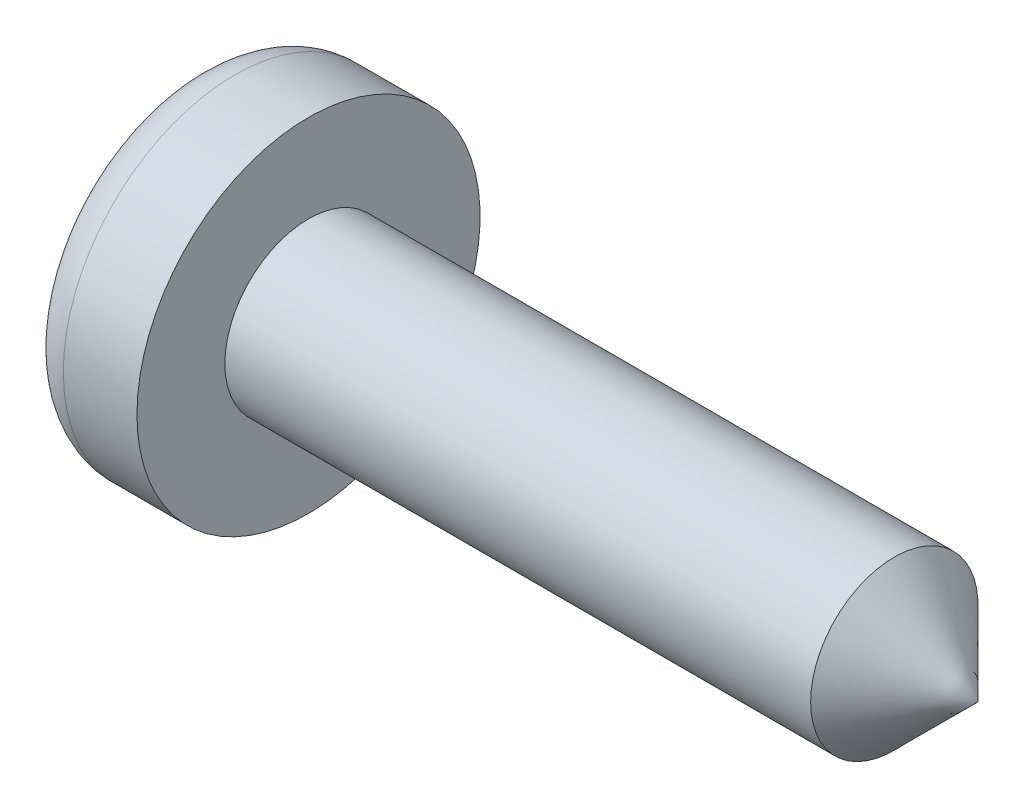
ISO-10303-21;
HEADER;
FILE_DESCRIPTION(('STEP AP214'),'2;1');
FILE_NAME('part.step','',(''),(''),'','','');
FILE_SCHEMA(('AUTOMOTIVE_DESIGN { 1 0 10303 214 1 1 1 1 }'));
ENDSEC;
DATA;
#1=APPLICATION_CONTEXT('core data for automotive mechanical design processes');
#2=APPLICATION_PROTOCOL_DEFINITION('international standard','automotive_design',2000,#1);
#3=PRODUCT_CONTEXT('',#1,'mechanical');
#4=PRODUCT('Part','Part','',(#3));
#5=PRODUCT_RELATED_PRODUCT_CATEGORY('part','',(#4));
#6=PRODUCT_DEFINITION_FORMATION('','',#4);
#7=PRODUCT_DEFINITION_CONTEXT('part definition',#1,'design');
#8=PRODUCT_DEFINITION('design','',#6,#7);
#9=PRODUCT_DEFINITION_SHAPE('','',#8);
#10=(LENGTH_UNIT() NAMED_UNIT(*) SI_UNIT(.MILLI.,.METRE.));
#11=(NAMED_UNIT(*) PLANE_ANGLE_UNIT() SI_UNIT($,.RADIAN.));
#12=(NAMED_UNIT(*) SI_UNIT($,.STERADIAN.) SOLID_ANGLE_UNIT());
#13=UNCERTAINTY_MEASURE_WITH_UNIT(LENGTH_MEASURE(1.E-05),#10,'distance_accuracy_value','');
#14=(GEOMETRIC_REPRESENTATION_CONTEXT(3) GLOBAL_UNCERTAINTY_ASSIGNED_CONTEXT((#13)) GLOBAL_UNIT_ASSIGNED_CONTEXT((#10,
#11,#12)) REPRESENTATION_CONTEXT('',''));
#15=CARTESIAN_POINT('',(0.,0.,0.));
#16=DIRECTION('',(0.,0.,1.));
#17=DIRECTION('',(1.,0.,0.));
#18=AXIS2_PLACEMENT_3D('',#15,#16,#17);
#19=CARTESIAN_POINT('',(0.,0.,0.));
#20=DIRECTION('',(1.,0.,0.));
#21=DIRECTION('',(0.,0.,-1.));
#22=AXIS2_PLACEMENT_3D('',#19,#20,#21);
#23=PLANE('',#22);
#24=CARTESIAN_POINT('',(0.,0.,0.));
#25=DIRECTION('',(1.,0.,0.));
#26=DIRECTION('',(0.,0.,-1.));
#27=AXIS2_PLACEMENT_3D('',#24,#25,#26);
#28=CIRCLE('',#27,1.55);
#29=CARTESIAN_POINT('',(0.,0.,-1.55));
#30=VERTEX_POINT('',#29);
#31=EDGE_CURVE('E47',#30,#30,#28,.F.);
#32=ORIENTED_EDGE('',*,*,#31,.T.);
#33=EDGE_LOOP('',(#32));
#34=FACE_BOUND('',#33,.T.);
#35=DIRECTION('',(0.,0.,-1.));
#36=VECTOR('',#35,1.);
#37=CARTESIAN_POINT('',(0.,0.3,-0.3));
#38=LINE('',#37,#36);
#39=CARTESIAN_POINT('',(0.,0.3,-0.3));
#40=VERTEX_POINT('',#39);
#41=CARTESIAN_POINT('',(0.,0.3,-1.));
#42=VERTEX_POINT('',#41);
#43=EDGE_CURVE('E181',#40,#42,#38,.T.);
#44=ORIENTED_EDGE('',*,*,#43,.F.);
#45=DIRECTION('',(0.,-1.,0.));
#46=VECTOR('',#45,1.);
#47=CARTESIAN_POINT('',(0.,1.,-0.3));
#48=LINE('',#47,#46);
#49=CARTESIAN_POINT('',(0.,1.,-0.3));
#50=VERTEX_POINT('',#49);
#51=EDGE_CURVE('E54',#50,#40,#48,.T.);
#52=ORIENTED_EDGE('',*,*,#51,.F.);
#53=DIRECTION('',(0.,0.,-1.));
#54=VECTOR('',#53,1.);
#55=CARTESIAN_POINT('',(0.,1.,0.3));
#56=LINE('',#55,#54);
#57=CARTESIAN_POINT('',(0.,1.,0.3));
#58=VERTEX_POINT('',#57);
#59=EDGE_CURVE('E149',#58,#50,#56,.T.);
#60=ORIENTED_EDGE('',*,*,#59,.F.);
#61=DIRECTION('',(0.,1.,0.));
#62=VECTOR('',#61,1.);
#63=CARTESIAN_POINT('',(0.,0.3,0.3));
#64=LINE('',#63,#62);
#65=CARTESIAN_POINT('',(0.,0.3,0.3));
#66=VERTEX_POINT('',#65);
#67=EDGE_CURVE('E152',#66,#58,#64,.T.);
#68=ORIENTED_EDGE('',*,*,#67,.F.);
#69=DIRECTION('',(0.,0.,-1.));
#70=VECTOR('',#69,1.);
#71=CARTESIAN_POINT('',(0.,0.3,1.));
#72=LINE('',#71,#70);
#73=CARTESIAN_POINT('',(0.,0.3,1.));
#74=VERTEX_POINT('',#73);
#75=EDGE_CURVE('E204',#74,#66,#72,.T.);
#76=ORIENTED_EDGE('',*,*,#75,.F.);
#77=DIRECTION('',(0.,1.,0.));
#78=VECTOR('',#77,1.);
#79=CARTESIAN_POINT('',(0.,-0.3,1.));
#80=LINE('',#79,#78);
#81=CARTESIAN_POINT('',(0.,-0.3,1.));
#82=VERTEX_POINT('',#81);
#83=EDGE_CURVE('E201',#82,#74,#80,.T.);
#84=ORIENTED_EDGE('',*,*,#83,.F.);
#85=DIRECTION('',(0.,0.,1.));
#86=VECTOR('',#85,1.);
#87=CARTESIAN_POINT('',(0.,-0.3,0.3));
#88=LINE('',#87,#86);
#89=CARTESIAN_POINT('',(0.,-0.3,0.3));
#90=VERTEX_POINT('',#89);
#91=EDGE_CURVE('E198',#90,#82,#88,.T.);
#92=ORIENTED_EDGE('',*,*,#91,.F.);
#93=DIRECTION('',(0.,1.,0.));
#94=VECTOR('',#93,1.);
#95=CARTESIAN_POINT('',(0.,-1.,0.3));
#96=LINE('',#95,#94);
#97=CARTESIAN_POINT('',(0.,-1.,0.3));
#98=VERTEX_POINT('',#97);
#99=EDGE_CURVE('E195',#98,#90,#96,.T.);
#100=ORIENTED_EDGE('',*,*,#99,.F.);
#101=DIRECTION('',(0.,0.,1.));
#102=VECTOR('',#101,1.);
#103=CARTESIAN_POINT('',(0.,-1.,-0.3));
#104=LINE('',#103,#102);
#105=CARTESIAN_POINT('',(0.,-1.,-0.3));
#106=VERTEX_POINT('',#105);
#107=EDGE_CURVE('E192',#106,#98,#104,.T.);
#108=ORIENTED_EDGE('',*,*,#107,.F.);
#109=DIRECTION('',(0.,-1.,0.));
#110=VECTOR('',#109,1.);
#111=CARTESIAN_POINT('',(0.,-0.3,-0.3));
#112=LINE('',#111,#110);
#113=CARTESIAN_POINT('',(0.,-0.3,-0.3));
#114=VERTEX_POINT('',#113);
#115=EDGE_CURVE('E189',#114,#106,#112,.T.);
#116=ORIENTED_EDGE('',*,*,#115,.F.);
#117=DIRECTION('',(0.,0.,1.));
#118=VECTOR('',#117,1.);
#119=CARTESIAN_POINT('',(0.,-0.3,-1.));
#120=LINE('',#119,#118);
#121=CARTESIAN_POINT('',(0.,-0.3,-1.));
#122=VERTEX_POINT('',#121);
#123=EDGE_CURVE('E186',#122,#114,#120,.T.);
#124=ORIENTED_EDGE('',*,*,#123,.F.);
#125=DIRECTION('',(0.,-1.,0.));
#126=VECTOR('',#125,1.);
#127=CARTESIAN_POINT('',(0.,0.3,-1.));
#128=LINE('',#127,#126);
#129=EDGE_CURVE('E183',#42,#122,#128,.T.);
#130=ORIENTED_EDGE('',*,*,#129,.F.);
#131=EDGE_LOOP('',(#44,#52,#60,#68,#76,#84,#92,#100,#108,#116,#124,#130));
#132=FACE_BOUND('',#131,.T.);
#133=ADVANCED_FACE('F39',(#34,#132),#23,.F.);
#134=CARTESIAN_POINT('',(-6.97654015251013,0.,0.));
#135=DIRECTION('',(-1.,0.,0.));
#136=DIRECTION('',(0.,0.,1.));
#137=AXIS2_PLACEMENT_3D('',#134,#135,#136);
#138=CYLINDRICAL_SURFACE('',#137,2.05);
#139=CARTESIAN_POINT('',(0.5,0.,0.));
#140=DIRECTION('',(1.,0.,0.));
#141=DIRECTION('',(0.,0.,-1.));
#142=AXIS2_PLACEMENT_3D('',#139,#140,#141);
#143=CIRCLE('',#142,2.05);
#144=CARTESIAN_POINT('',(0.5,0.,-2.05));
#145=VERTEX_POINT('',#144);
#146=EDGE_CURVE('E11',#145,#145,#143,.T.);
#147=ORIENTED_EDGE('',*,*,#146,.T.);
#148=EDGE_LOOP('',(#147));
#149=FACE_BOUND('',#148,.T.);
#150=CARTESIAN_POINT('',(1.38,0.,0.));
#151=DIRECTION('',(-1.,0.,0.));
#152=DIRECTION('',(0.,0.,1.));
#153=AXIS2_PLACEMENT_3D('',#150,#151,#152);
#154=CIRCLE('',#153,2.05);
#155=CARTESIAN_POINT('',(1.38,0.,2.05));
#156=VERTEX_POINT('',#155);
#157=EDGE_CURVE('E236',#156,#156,#154,.T.);
#158=ORIENTED_EDGE('',*,*,#157,.T.);
#159=EDGE_LOOP('',(#158));
#160=FACE_BOUND('',#159,.T.);
#161=ADVANCED_FACE('F251',(#149,#160),#138,.T.);
#162=CARTESIAN_POINT('',(1.38,2.05,0.));
#163=DIRECTION('',(-1.,0.,0.));
#164=DIRECTION('',(0.,0.,1.));
#165=AXIS2_PLACEMENT_3D('',#162,#163,#164);
#166=PLANE('',#165);
#167=ORIENTED_EDGE('',*,*,#157,.F.);
#168=EDGE_LOOP('',(#167));
#169=FACE_BOUND('',#168,.T.);
#170=CARTESIAN_POINT('',(1.38,0.,0.));
#171=DIRECTION('',(-1.,0.,0.));
#172=DIRECTION('',(0.,0.,1.));
#173=AXIS2_PLACEMENT_3D('',#170,#171,#172);
#174=CIRCLE('',#173,1.);
#175=CARTESIAN_POINT('',(1.38,0.,1.));
#176=VERTEX_POINT('',#175);
#177=EDGE_CURVE('E233',#176,#176,#174,.T.);
#178=ORIENTED_EDGE('',*,*,#177,.T.);
#179=EDGE_LOOP('',(#178));
#180=FACE_BOUND('',#179,.T.);
#181=ADVANCED_FACE('F255',(#169,#180),#166,.F.);
#182=CARTESIAN_POINT('',(-6.97654015251013,0.,0.));
#183=DIRECTION('',(-1.,0.,0.));
#184=DIRECTION('',(0.,0.,1.));
#185=AXIS2_PLACEMENT_3D('',#182,#183,#184);
#186=CYLINDRICAL_SURFACE('',#185,1.);
#187=ORIENTED_EDGE('',*,*,#177,.F.);
#188=EDGE_LOOP('',(#187));
#189=FACE_BOUND('',#188,.T.);
#190=CARTESIAN_POINT('',(8.37999999999999,0.,0.));
#191=DIRECTION('',(-1.,0.,0.));
#192=DIRECTION('',(0.,0.,1.));
#193=AXIS2_PLACEMENT_3D('',#190,#191,#192);
#194=CIRCLE('',#193,1.);
#195=CARTESIAN_POINT('',(8.37999999999999,0.,1.));
#196=VERTEX_POINT('',#195);
#197=EDGE_CURVE('E211',#196,#196,#194,.T.);
#198=ORIENTED_EDGE('',*,*,#197,.T.);
#199=EDGE_LOOP('',(#198));
#200=FACE_BOUND('',#199,.T.);
#201=ADVANCED_FACE('F261',(#189,#200),#186,.T.);
#202=CARTESIAN_POINT('',(9.38,0.,0.));
#203=DIRECTION('',(-1.,0.,0.));
#204=DIRECTION('',(0.,0.,1.));
#205=AXIS2_PLACEMENT_3D('',#202,#203,#204);
#206=CONICAL_SURFACE('',#205,0.,0.785398163397443);
#207=ORIENTED_EDGE('',*,*,#197,.F.);
#208=EDGE_LOOP('',(#207));
#209=FACE_BOUND('',#208,.T.);
#210=CARTESIAN_POINT('',(9.38,0.,0.));
#211=VERTEX_POINT('',#210);
#212=VERTEX_LOOP('',#211);
#213=FACE_BOUND('',#212,.T.);
#214=ADVANCED_FACE('F265',(#209,#213),#206,.T.);
#215=CARTESIAN_POINT('',(0.5,1.,-0.3));
#216=DIRECTION('',(0.,0.,-1.));
#217=DIRECTION('',(0.,1.,0.));
#218=AXIS2_PLACEMENT_3D('',#215,#216,#217);
#219=PLANE('',#218);
#220=ORIENTED_EDGE('',*,*,#51,.T.);
#221=DIRECTION('',(-1.,0.,0.));
#222=VECTOR('',#221,1.);
#223=CARTESIAN_POINT('',(0.5,0.3,-0.3));
#224=LINE('',#223,#222);
#225=CARTESIAN_POINT('',(0.5,0.3,-0.3));
#226=VERTEX_POINT('',#225);
#227=EDGE_CURVE('E126',#226,#40,#224,.T.);
#228=ORIENTED_EDGE('',*,*,#227,.F.);
#229=DIRECTION('',(0.,-1.,0.));
#230=VECTOR('',#229,1.);
#231=CARTESIAN_POINT('',(0.5,1.,-0.3));
#232=LINE('',#231,#230);
#233=CARTESIAN_POINT('',(0.5,1.,-0.3));
#234=VERTEX_POINT('',#233);
#235=EDGE_CURVE('E130',#234,#226,#232,.T.);
#236=ORIENTED_EDGE('',*,*,#235,.F.);
#237=DIRECTION('',(-1.,0.,0.));
#238=VECTOR('',#237,1.);
#239=CARTESIAN_POINT('',(0.5,1.,-0.3));
#240=LINE('',#239,#238);
#241=EDGE_CURVE('E209',#234,#50,#240,.T.);
#242=ORIENTED_EDGE('',*,*,#241,.T.);
#243=EDGE_LOOP('',(#220,#228,#236,#242));
#244=FACE_BOUND('',#243,.T.);
#245=ADVANCED_FACE('F128',(#244),#219,.F.);
#246=CARTESIAN_POINT('',(0.5,1.,0.3));
#247=DIRECTION('',(0.,1.,0.));
#248=DIRECTION('',(0.,0.,1.));
#249=AXIS2_PLACEMENT_3D('',#246,#247,#248);
#250=PLANE('',#249);
#251=ORIENTED_EDGE('',*,*,#59,.T.);
#252=ORIENTED_EDGE('',*,*,#241,.F.);
#253=DIRECTION('',(0.,0.,-1.));
#254=VECTOR('',#253,1.);
#255=CARTESIAN_POINT('',(0.5,1.,0.3));
#256=LINE('',#255,#254);
#257=CARTESIAN_POINT('',(0.5,1.,0.3));
#258=VERTEX_POINT('',#257);
#259=EDGE_CURVE('E136',#258,#234,#256,.T.);
#260=ORIENTED_EDGE('',*,*,#259,.F.);
#261=DIRECTION('',(-1.,0.,0.));
#262=VECTOR('',#261,1.);
#263=CARTESIAN_POINT('',(0.5,1.,0.3));
#264=LINE('',#263,#262);
#265=EDGE_CURVE('E212',#258,#58,#264,.T.);
#266=ORIENTED_EDGE('',*,*,#265,.T.);
#267=EDGE_LOOP('',(#251,#252,#260,#266));
#268=FACE_BOUND('',#267,.T.);
#269=ADVANCED_FACE('F272',(#268),#250,.F.);
#270=CARTESIAN_POINT('',(0.5,0.3,0.3));
#271=DIRECTION('',(0.,0.,1.));
#272=DIRECTION('',(0.,-1.,0.));
#273=AXIS2_PLACEMENT_3D('',#270,#271,#272);
#274=PLANE('',#273);
#275=ORIENTED_EDGE('',*,*,#67,.T.);
#276=ORIENTED_EDGE('',*,*,#265,.F.);
#277=DIRECTION('',(0.,1.,0.));
#278=VECTOR('',#277,1.);
#279=CARTESIAN_POINT('',(0.5,0.3,0.3));
#280=LINE('',#279,#278);
#281=CARTESIAN_POINT('',(0.5,0.3,0.3));
#282=VERTEX_POINT('',#281);
#283=EDGE_CURVE('E177',#282,#258,#280,.T.);
#284=ORIENTED_EDGE('',*,*,#283,.F.);
#285=DIRECTION('',(-1.,0.,0.));
#286=VECTOR('',#285,1.);
#287=CARTESIAN_POINT('',(0.5,0.3,0.3));
#288=LINE('',#287,#286);
#289=EDGE_CURVE('E214',#282,#66,#288,.T.);
#290=ORIENTED_EDGE('',*,*,#289,.T.);
#291=EDGE_LOOP('',(#275,#276,#284,#290));
#292=FACE_BOUND('',#291,.T.);
#293=ADVANCED_FACE('F306',(#292),#274,.F.);
#294=CARTESIAN_POINT('',(0.5,0.3,1.));
#295=DIRECTION('',(0.,1.,0.));
#296=DIRECTION('',(0.,0.,1.));
#297=AXIS2_PLACEMENT_3D('',#294,#295,#296);
#298=PLANE('',#297);
#299=ORIENTED_EDGE('',*,*,#75,.T.);
#300=ORIENTED_EDGE('',*,*,#289,.F.);
#301=DIRECTION('',(0.,0.,-1.));
#302=VECTOR('',#301,1.);
#303=CARTESIAN_POINT('',(0.5,0.3,1.));
#304=LINE('',#303,#302);
#305=CARTESIAN_POINT('',(0.5,0.3,1.));
#306=VERTEX_POINT('',#305);
#307=EDGE_CURVE('E174',#306,#282,#304,.T.);
#308=ORIENTED_EDGE('',*,*,#307,.F.);
#309=DIRECTION('',(-1.,0.,0.));
#310=VECTOR('',#309,1.);
#311=CARTESIAN_POINT('',(0.5,0.3,1.));
#312=LINE('',#311,#310);
#313=EDGE_CURVE('E216',#306,#74,#312,.T.);
#314=ORIENTED_EDGE('',*,*,#313,.T.);
#315=EDGE_LOOP('',(#299,#300,#308,#314));
#316=FACE_BOUND('',#315,.T.);
#317=ADVANCED_FACE('F302',(#316),#298,.F.);
#318=CARTESIAN_POINT('',(0.5,-0.3,1.));
#319=DIRECTION('',(0.,0.,1.));
#320=DIRECTION('',(1.,0.,0.));
#321=AXIS2_PLACEMENT_3D('',#318,#319,#320);
#322=PLANE('',#321);
#323=ORIENTED_EDGE('',*,*,#83,.T.);
#324=ORIENTED_EDGE('',*,*,#313,.F.);
#325=DIRECTION('',(0.,1.,0.));
#326=VECTOR('',#325,1.);
#327=CARTESIAN_POINT('',(0.5,-0.3,1.));
#328=LINE('',#327,#326);
#329=CARTESIAN_POINT('',(0.5,-0.3,1.));
#330=VERTEX_POINT('',#329);
#331=EDGE_CURVE('E171',#330,#306,#328,.T.);
#332=ORIENTED_EDGE('',*,*,#331,.F.);
#333=DIRECTION('',(-1.,0.,0.));
#334=VECTOR('',#333,1.);
#335=CARTESIAN_POINT('',(0.5,-0.3,1.));
#336=LINE('',#335,#334);
#337=EDGE_CURVE('E218',#330,#82,#336,.T.);
#338=ORIENTED_EDGE('',*,*,#337,.T.);
#339=EDGE_LOOP('',(#323,#324,#332,#338));
#340=FACE_BOUND('',#339,.T.);
#341=ADVANCED_FACE('F298',(#340),#322,.F.);
#342=CARTESIAN_POINT('',(0.5,-0.3,0.3));
#343=DIRECTION('',(0.,-1.,0.));
#344=DIRECTION('',(0.,0.,-1.));
#345=AXIS2_PLACEMENT_3D('',#342,#343,#344);
#346=PLANE('',#345);
#347=ORIENTED_EDGE('',*,*,#91,.T.);
#348=ORIENTED_EDGE('',*,*,#337,.F.);
#349=DIRECTION('',(0.,0.,1.));
#350=VECTOR('',#349,1.);
#351=CARTESIAN_POINT('',(0.5,-0.3,0.3));
#352=LINE('',#351,#350);
#353=CARTESIAN_POINT('',(0.5,-0.3,0.3));
#354=VERTEX_POINT('',#353);
#355=EDGE_CURVE('E168',#354,#330,#352,.T.);
#356=ORIENTED_EDGE('',*,*,#355,.F.);
#357=DIRECTION('',(-1.,0.,0.));
#358=VECTOR('',#357,1.);
#359=CARTESIAN_POINT('',(0.5,-0.3,0.3));
#360=LINE('',#359,#358);
#361=EDGE_CURVE('E220',#354,#90,#360,.T.);
#362=ORIENTED_EDGE('',*,*,#361,.T.);
#363=EDGE_LOOP('',(#347,#348,#356,#362));
#364=FACE_BOUND('',#363,.T.);
#365=ADVANCED_FACE('F294',(#364),#346,.F.);
#366=CARTESIAN_POINT('',(0.5,-1.,0.3));
#367=DIRECTION('',(0.,0.,1.));
#368=DIRECTION('',(1.,0.,0.));
#369=AXIS2_PLACEMENT_3D('',#366,#367,#368);
#370=PLANE('',#369);
#371=ORIENTED_EDGE('',*,*,#99,.T.);
#372=ORIENTED_EDGE('',*,*,#361,.F.);
#373=DIRECTION('',(0.,1.,0.));
#374=VECTOR('',#373,1.);
#375=CARTESIAN_POINT('',(0.5,-1.,0.3));
#376=LINE('',#375,#374);
#377=CARTESIAN_POINT('',(0.5,-1.,0.3));
#378=VERTEX_POINT('',#377);
#379=EDGE_CURVE('E165',#378,#354,#376,.T.);
#380=ORIENTED_EDGE('',*,*,#379,.F.);
#381=DIRECTION('',(-1.,0.,0.));
#382=VECTOR('',#381,1.);
#383=CARTESIAN_POINT('',(0.5,-1.,0.3));
#384=LINE('',#383,#382);
#385=EDGE_CURVE('E222',#378,#98,#384,.T.);
#386=ORIENTED_EDGE('',*,*,#385,.T.);
#387=EDGE_LOOP('',(#371,#372,#380,#386));
#388=FACE_BOUND('',#387,.T.);
#389=ADVANCED_FACE('F290',(#388),#370,.F.);
#390=CARTESIAN_POINT('',(0.5,-1.,-0.3));
#391=DIRECTION('',(0.,-1.,0.));
#392=DIRECTION('',(0.,0.,-1.));
#393=AXIS2_PLACEMENT_3D('',#390,#391,#392);
#394=PLANE('',#393);
#395=ORIENTED_EDGE('',*,*,#107,.T.);
#396=ORIENTED_EDGE('',*,*,#385,.F.);
#397=DIRECTION('',(0.,0.,1.));
#398=VECTOR('',#397,1.);
#399=CARTESIAN_POINT('',(0.5,-1.,-0.3));
#400=LINE('',#399,#398);
#401=CARTESIAN_POINT('',(0.5,-1.,-0.3));
#402=VERTEX_POINT('',#401);
#403=EDGE_CURVE('E162',#402,#378,#400,.T.);
#404=ORIENTED_EDGE('',*,*,#403,.F.);
#405=DIRECTION('',(-1.,0.,0.));
#406=VECTOR('',#405,1.);
#407=CARTESIAN_POINT('',(0.5,-1.,-0.3));
#408=LINE('',#407,#406);
#409=EDGE_CURVE('E224',#402,#106,#408,.T.);
#410=ORIENTED_EDGE('',*,*,#409,.T.);
#411=EDGE_LOOP('',(#395,#396,#404,#410));
#412=FACE_BOUND('',#411,.T.);
#413=ADVANCED_FACE('F286',(#412),#394,.F.);
#414=CARTESIAN_POINT('',(0.5,-0.3,-0.3));
#415=DIRECTION('',(0.,0.,-1.));
#416=DIRECTION('',(0.,1.,0.));
#417=AXIS2_PLACEMENT_3D('',#414,#415,#416);
#418=PLANE('',#417);
#419=ORIENTED_EDGE('',*,*,#115,.T.);
#420=ORIENTED_EDGE('',*,*,#409,.F.);
#421=DIRECTION('',(0.,-1.,0.));
#422=VECTOR('',#421,1.);
#423=CARTESIAN_POINT('',(0.5,-0.3,-0.3));
#424=LINE('',#423,#422);
#425=CARTESIAN_POINT('',(0.5,-0.3,-0.3));
#426=VERTEX_POINT('',#425);
#427=EDGE_CURVE('E159',#426,#402,#424,.T.);
#428=ORIENTED_EDGE('',*,*,#427,.F.);
#429=DIRECTION('',(-1.,0.,0.));
#430=VECTOR('',#429,1.);
#431=CARTESIAN_POINT('',(0.5,-0.3,-0.3));
#432=LINE('',#431,#430);
#433=EDGE_CURVE('E226',#426,#114,#432,.T.);
#434=ORIENTED_EDGE('',*,*,#433,.T.);
#435=EDGE_LOOP('',(#419,#420,#428,#434));
#436=FACE_BOUND('',#435,.T.);
#437=ADVANCED_FACE('F282',(#436),#418,.F.);
#438=CARTESIAN_POINT('',(0.5,-0.3,-1.));
#439=DIRECTION('',(0.,-1.,0.));
#440=DIRECTION('',(0.,0.,-1.));
#441=AXIS2_PLACEMENT_3D('',#438,#439,#440);
#442=PLANE('',#441);
#443=ORIENTED_EDGE('',*,*,#123,.T.);
#444=ORIENTED_EDGE('',*,*,#433,.F.);
#445=DIRECTION('',(0.,0.,1.));
#446=VECTOR('',#445,1.);
#447=CARTESIAN_POINT('',(0.5,-0.3,-1.));
#448=LINE('',#447,#446);
#449=CARTESIAN_POINT('',(0.5,-0.3,-1.));
#450=VERTEX_POINT('',#449);
#451=EDGE_CURVE('E156',#450,#426,#448,.T.);
#452=ORIENTED_EDGE('',*,*,#451,.F.);
#453=DIRECTION('',(-1.,0.,0.));
#454=VECTOR('',#453,1.);
#455=CARTESIAN_POINT('',(0.5,-0.3,-1.));
#456=LINE('',#455,#454);
#457=EDGE_CURVE('E228',#450,#122,#456,.T.);
#458=ORIENTED_EDGE('',*,*,#457,.T.);
#459=EDGE_LOOP('',(#443,#444,#452,#458));
#460=FACE_BOUND('',#459,.T.);
#461=ADVANCED_FACE('F278',(#460),#442,.F.);
#462=CARTESIAN_POINT('',(0.5,0.3,-1.));
#463=DIRECTION('',(0.,0.,-1.));
#464=DIRECTION('',(-1.,0.,0.));
#465=AXIS2_PLACEMENT_3D('',#462,#463,#464);
#466=PLANE('',#465);
#467=ORIENTED_EDGE('',*,*,#129,.T.);
#468=ORIENTED_EDGE('',*,*,#457,.F.);
#469=DIRECTION('',(0.,-1.,0.));
#470=VECTOR('',#469,1.);
#471=CARTESIAN_POINT('',(0.5,0.3,-1.));
#472=LINE('',#471,#470);
#473=CARTESIAN_POINT('',(0.5,0.3,-1.));
#474=VERTEX_POINT('',#473);
#475=EDGE_CURVE('E144',#474,#450,#472,.T.);
#476=ORIENTED_EDGE('',*,*,#475,.F.);
#477=DIRECTION('',(-1.,0.,0.));
#478=VECTOR('',#477,1.);
#479=CARTESIAN_POINT('',(0.5,0.3,-1.));
#480=LINE('',#479,#478);
#481=EDGE_CURVE('E135',#474,#42,#480,.T.);
#482=ORIENTED_EDGE('',*,*,#481,.T.);
#483=EDGE_LOOP('',(#467,#468,#476,#482));
#484=FACE_BOUND('',#483,.T.);
#485=ADVANCED_FACE('F275',(#484),#466,.F.);
#486=CARTESIAN_POINT('',(0.5,0.3,-0.3));
#487=DIRECTION('',(0.,1.,0.));
#488=DIRECTION('',(0.,0.,1.));
#489=AXIS2_PLACEMENT_3D('',#486,#487,#488);
#490=PLANE('',#489);
#491=ORIENTED_EDGE('',*,*,#43,.T.);
#492=ORIENTED_EDGE('',*,*,#481,.F.);
#493=DIRECTION('',(0.,0.,-1.));
#494=VECTOR('',#493,1.);
#495=CARTESIAN_POINT('',(0.5,0.3,-0.3));
#496=LINE('',#495,#494);
#497=EDGE_CURVE('E139',#226,#474,#496,.T.);
#498=ORIENTED_EDGE('',*,*,#497,.F.);
#499=ORIENTED_EDGE('',*,*,#227,.T.);
#500=EDGE_LOOP('',(#491,#492,#498,#499));
#501=FACE_BOUND('',#500,.T.);
#502=ADVANCED_FACE('F140',(#501),#490,.F.);
#503=CARTESIAN_POINT('',(0.5,0.,0.));
#504=DIRECTION('',(1.,0.,0.));
#505=DIRECTION('',(0.,0.,-1.));
#506=AXIS2_PLACEMENT_3D('',#503,#504,#505);
#507=PLANE('',#506);
#508=ORIENTED_EDGE('',*,*,#235,.T.);
#509=ORIENTED_EDGE('',*,*,#497,.T.);
#510=ORIENTED_EDGE('',*,*,#475,.T.);
#511=ORIENTED_EDGE('',*,*,#451,.T.);
#512=ORIENTED_EDGE('',*,*,#427,.T.);
#513=ORIENTED_EDGE('',*,*,#403,.T.);
#514=ORIENTED_EDGE('',*,*,#379,.T.);
#515=ORIENTED_EDGE('',*,*,#355,.T.);
#516=ORIENTED_EDGE('',*,*,#331,.T.);
#517=ORIENTED_EDGE('',*,*,#307,.T.);
#518=ORIENTED_EDGE('',*,*,#283,.T.);
#519=ORIENTED_EDGE('',*,*,#259,.T.);
#520=EDGE_LOOP('',(#508,#509,#510,#511,#512,#513,#514,#515,#516,#517,#518,#519));
#521=FACE_BOUND('',#520,.T.);
#522=ADVANCED_FACE('F146',(#521),#507,.F.);
#523=CARTESIAN_POINT('',(0.5,0.,0.));
#524=DIRECTION('',(1.,0.,0.));
#525=DIRECTION('',(0.,0.,-1.));
#526=AXIS2_PLACEMENT_3D('',#523,#524,#525);
#527=TOROIDAL_SURFACE('',#526,1.55,0.5);
#528=ORIENTED_EDGE('',*,*,#146,.F.);
#529=EDGE_LOOP('',(#528));
#530=FACE_BOUND('',#529,.T.);
#531=ORIENTED_EDGE('',*,*,#31,.F.);
#532=EDGE_LOOP('',(#531));
#533=FACE_BOUND('',#532,.T.);
#534=ADVANCED_FACE('F41',(#530,#533),#527,.T.);
#535=CLOSED_SHELL('',(#133,#161,#181,#201,#214,#245,#269,#293,#317,#341,#365,#389,#413,#437,
#461,#485,#502,#522,#534));
#536=MANIFOLD_SOLID_BREP('B2',#535);
#537=ADVANCED_BREP_SHAPE_REPRESENTATION('',(#18,#536),#14);
#538=SHAPE_DEFINITION_REPRESENTATION(#9,#537);
ENDSEC;
END-ISO-10303-21;
